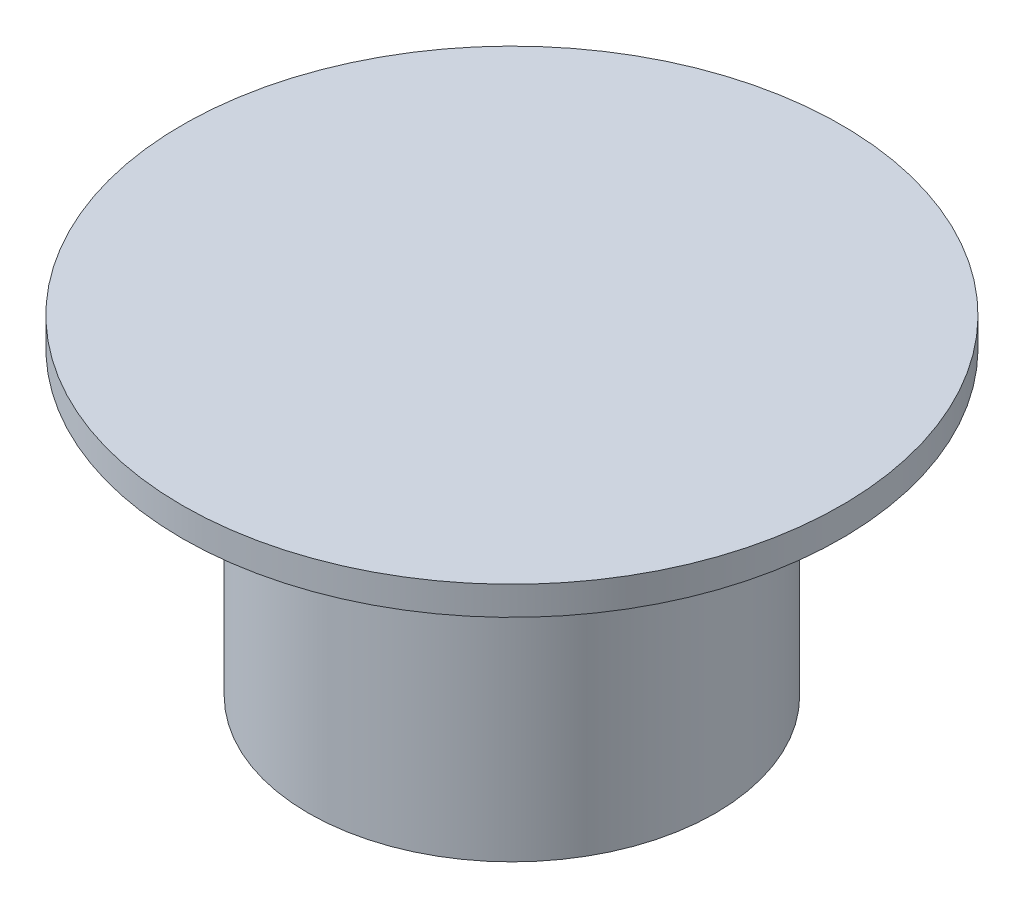
ISO-10303-21;
HEADER;
FILE_DESCRIPTION(('STEP AP214'),'2;1');
FILE_NAME('part.step','',(''),(''),'','','');
FILE_SCHEMA(('AUTOMOTIVE_DESIGN { 1 0 10303 214 1 1 1 1 }'));
ENDSEC;
DATA;
#1=APPLICATION_CONTEXT('core data for automotive mechanical design processes');
#2=APPLICATION_PROTOCOL_DEFINITION('international standard','automotive_design',2000,#1);
#3=PRODUCT_CONTEXT('',#1,'mechanical');
#4=PRODUCT('Part','Part','',(#3));
#5=PRODUCT_RELATED_PRODUCT_CATEGORY('part','',(#4));
#6=PRODUCT_DEFINITION_FORMATION('','',#4);
#7=PRODUCT_DEFINITION_CONTEXT('part definition',#1,'design');
#8=PRODUCT_DEFINITION('design','',#6,#7);
#9=PRODUCT_DEFINITION_SHAPE('','',#8);
#10=(LENGTH_UNIT() NAMED_UNIT(*) SI_UNIT(.MILLI.,.METRE.));
#11=(NAMED_UNIT(*) PLANE_ANGLE_UNIT() SI_UNIT($,.RADIAN.));
#12=(NAMED_UNIT(*) SI_UNIT($,.STERADIAN.) SOLID_ANGLE_UNIT());
#13=UNCERTAINTY_MEASURE_WITH_UNIT(LENGTH_MEASURE(1.E-05),#10,'distance_accuracy_value','');
#14=(GEOMETRIC_REPRESENTATION_CONTEXT(3) GLOBAL_UNCERTAINTY_ASSIGNED_CONTEXT((#13)) GLOBAL_UNIT_ASSIGNED_CONTEXT((#10,
#11,#12)) REPRESENTATION_CONTEXT('',''));
#15=CARTESIAN_POINT('',(0.,0.,0.));
#16=DIRECTION('',(0.,0.,1.));
#17=DIRECTION('',(1.,0.,0.));
#18=AXIS2_PLACEMENT_3D('',#15,#16,#17);
#19=CARTESIAN_POINT('',(0.,10.5,0.));
#20=DIRECTION('',(0.,-1.,0.));
#21=DIRECTION('',(0.,0.,-1.));
#22=AXIS2_PLACEMENT_3D('',#19,#20,#21);
#23=CYLINDRICAL_SURFACE('',#22,7.1);
#24=CARTESIAN_POINT('',(0.,10.5,0.));
#25=DIRECTION('',(0.,1.,0.));
#26=DIRECTION('',(0.,0.,1.));
#27=AXIS2_PLACEMENT_3D('',#24,#25,#26);
#28=CIRCLE('',#27,7.1);
#29=CARTESIAN_POINT('',(0.,10.5,7.1));
#30=VERTEX_POINT('',#29);
#31=EDGE_CURVE('E11',#30,#30,#28,.T.);
#32=ORIENTED_EDGE('',*,*,#31,.F.);
#33=EDGE_LOOP('',(#32));
#34=FACE_BOUND('',#33,.T.);
#35=CARTESIAN_POINT('',(0.,0.,0.));
#36=DIRECTION('',(0.,1.,0.));
#37=DIRECTION('',(0.,0.,1.));
#38=AXIS2_PLACEMENT_3D('',#35,#36,#37);
#39=CIRCLE('',#38,7.1);
#40=CARTESIAN_POINT('',(0.,0.,7.1));
#41=VERTEX_POINT('',#40);
#42=EDGE_CURVE('E36',#41,#41,#39,.T.);
#43=ORIENTED_EDGE('',*,*,#42,.T.);
#44=EDGE_LOOP('',(#43));
#45=FACE_BOUND('',#44,.T.);
#46=ADVANCED_FACE('F33',(#34,#45),#23,.T.);
#47=CARTESIAN_POINT('',(0.,0.,0.));
#48=DIRECTION('',(0.,1.,0.));
#49=DIRECTION('',(0.,0.,1.));
#50=AXIS2_PLACEMENT_3D('',#47,#48,#49);
#51=PLANE('',#50);
#52=DIRECTION('',(1.,0.,0.));
#53=VECTOR('',#52,1.);
#54=CARTESIAN_POINT('',(-2.5,0.,-1.5));
#55=LINE('',#54,#53);
#56=CARTESIAN_POINT('',(-2.5,0.,-1.5));
#57=VERTEX_POINT('',#56);
#58=CARTESIAN_POINT('',(2.5,0.,-1.5));
#59=VERTEX_POINT('',#58);
#60=EDGE_CURVE('E82',#57,#59,#55,.T.);
#61=ORIENTED_EDGE('',*,*,#60,.F.);
#62=DIRECTION('',(0.,0.,-1.));
#63=VECTOR('',#62,1.);
#64=CARTESIAN_POINT('',(-2.5,0.,1.5));
#65=LINE('',#64,#63);
#66=CARTESIAN_POINT('',(-2.5,0.,1.5));
#67=VERTEX_POINT('',#66);
#68=EDGE_CURVE('E47',#67,#57,#65,.T.);
#69=ORIENTED_EDGE('',*,*,#68,.F.);
#70=DIRECTION('',(-1.,0.,0.));
#71=VECTOR('',#70,1.);
#72=CARTESIAN_POINT('',(-2.5,0.,1.5));
#73=LINE('',#72,#71);
#74=CARTESIAN_POINT('',(2.5,0.,1.5));
#75=VERTEX_POINT('',#74);
#76=EDGE_CURVE('E98',#75,#67,#73,.T.);
#77=ORIENTED_EDGE('',*,*,#76,.F.);
#78=DIRECTION('',(0.,0.,1.));
#79=VECTOR('',#78,1.);
#80=CARTESIAN_POINT('',(2.5,0.,1.5));
#81=LINE('',#80,#79);
#82=EDGE_CURVE('E104',#59,#75,#81,.T.);
#83=ORIENTED_EDGE('',*,*,#82,.F.);
#84=EDGE_LOOP('',(#61,#69,#77,#83));
#85=FACE_BOUND('',#84,.T.);
#86=ORIENTED_EDGE('',*,*,#42,.F.);
#87=EDGE_LOOP('',(#86));
#88=FACE_BOUND('',#87,.T.);
#89=ADVANCED_FACE('F122',(#85,#88),#51,.F.);
#90=CARTESIAN_POINT('',(0.,10.5,0.));
#91=DIRECTION('',(0.,1.,0.));
#92=DIRECTION('',(0.,0.,1.));
#93=AXIS2_PLACEMENT_3D('',#90,#91,#92);
#94=PLANE('',#93);
#95=CARTESIAN_POINT('',(0.,10.5,0.));
#96=DIRECTION('',(0.,1.,0.));
#97=DIRECTION('',(0.,0.,1.));
#98=AXIS2_PLACEMENT_3D('',#95,#96,#97);
#99=CIRCLE('',#98,11.5);
#100=CARTESIAN_POINT('',(0.,10.5,11.5));
#101=VERTEX_POINT('',#100);
#102=EDGE_CURVE('E108',#101,#101,#99,.T.);
#103=ORIENTED_EDGE('',*,*,#102,.F.);
#104=EDGE_LOOP('',(#103));
#105=FACE_BOUND('',#104,.T.);
#106=ORIENTED_EDGE('',*,*,#31,.T.);
#107=EDGE_LOOP('',(#106));
#108=FACE_BOUND('',#107,.T.);
#109=ADVANCED_FACE('F119',(#105,#108),#94,.F.);
#110=CARTESIAN_POINT('',(0.,11.5,0.));
#111=DIRECTION('',(0.,-1.,0.));
#112=DIRECTION('',(0.,0.,-1.));
#113=AXIS2_PLACEMENT_3D('',#110,#111,#112);
#114=CYLINDRICAL_SURFACE('',#113,11.5);
#115=CARTESIAN_POINT('',(0.,11.5,0.));
#116=DIRECTION('',(0.,1.,0.));
#117=DIRECTION('',(0.,0.,1.));
#118=AXIS2_PLACEMENT_3D('',#115,#116,#117);
#119=CIRCLE('',#118,11.5);
#120=CARTESIAN_POINT('',(0.,11.5,11.5));
#121=VERTEX_POINT('',#120);
#122=EDGE_CURVE('E111',#121,#121,#119,.T.);
#123=ORIENTED_EDGE('',*,*,#122,.F.);
#124=EDGE_LOOP('',(#123));
#125=FACE_BOUND('',#124,.T.);
#126=ORIENTED_EDGE('',*,*,#102,.T.);
#127=EDGE_LOOP('',(#126));
#128=FACE_BOUND('',#127,.T.);
#129=ADVANCED_FACE('F117',(#125,#128),#114,.T.);
#130=CARTESIAN_POINT('',(0.,11.5,0.));
#131=DIRECTION('',(0.,1.,0.));
#132=DIRECTION('',(0.,0.,1.));
#133=AXIS2_PLACEMENT_3D('',#130,#131,#132);
#134=PLANE('',#133);
#135=ORIENTED_EDGE('',*,*,#122,.T.);
#136=EDGE_LOOP('',(#135));
#137=FACE_BOUND('',#136,.T.);
#138=ADVANCED_FACE('F137',(#137),#134,.T.);
#139=CARTESIAN_POINT('',(-2.5,6.,1.5));
#140=DIRECTION('',(-1.,0.,0.));
#141=DIRECTION('',(0.,0.,1.));
#142=AXIS2_PLACEMENT_3D('',#139,#140,#141);
#143=PLANE('',#142);
#144=ORIENTED_EDGE('',*,*,#68,.T.);
#145=DIRECTION('',(0.,-1.,0.));
#146=VECTOR('',#145,1.);
#147=CARTESIAN_POINT('',(-2.5,6.,-1.5));
#148=LINE('',#147,#146);
#149=CARTESIAN_POINT('',(-2.5,6.,-1.5));
#150=VERTEX_POINT('',#149);
#151=EDGE_CURVE('E70',#150,#57,#148,.T.);
#152=ORIENTED_EDGE('',*,*,#151,.F.);
#153=DIRECTION('',(0.,0.,-1.));
#154=VECTOR('',#153,1.);
#155=CARTESIAN_POINT('',(-2.5,6.,1.5));
#156=LINE('',#155,#154);
#157=CARTESIAN_POINT('',(-2.5,6.,1.5));
#158=VERTEX_POINT('',#157);
#159=EDGE_CURVE('E96',#158,#150,#156,.T.);
#160=ORIENTED_EDGE('',*,*,#159,.F.);
#161=DIRECTION('',(0.,-1.,0.));
#162=VECTOR('',#161,1.);
#163=CARTESIAN_POINT('',(-2.5,6.,1.5));
#164=LINE('',#163,#162);
#165=EDGE_CURVE('E55',#158,#67,#164,.T.);
#166=ORIENTED_EDGE('',*,*,#165,.T.);
#167=EDGE_LOOP('',(#144,#152,#160,#166));
#168=FACE_BOUND('',#167,.T.);
#169=ADVANCED_FACE('F142',(#168),#143,.F.);
#170=CARTESIAN_POINT('',(-2.5,6.,1.5));
#171=DIRECTION('',(0.,0.,1.));
#172=DIRECTION('',(1.,0.,0.));
#173=AXIS2_PLACEMENT_3D('',#170,#171,#172);
#174=PLANE('',#173);
#175=ORIENTED_EDGE('',*,*,#76,.T.);
#176=ORIENTED_EDGE('',*,*,#165,.F.);
#177=DIRECTION('',(-1.,0.,0.));
#178=VECTOR('',#177,1.);
#179=CARTESIAN_POINT('',(-2.5,6.,1.5));
#180=LINE('',#179,#178);
#181=CARTESIAN_POINT('',(2.5,6.,1.5));
#182=VERTEX_POINT('',#181);
#183=EDGE_CURVE('E93',#182,#158,#180,.T.);
#184=ORIENTED_EDGE('',*,*,#183,.F.);
#185=DIRECTION('',(0.,-1.,0.));
#186=VECTOR('',#185,1.);
#187=CARTESIAN_POINT('',(2.5,6.,1.5));
#188=LINE('',#187,#186);
#189=EDGE_CURVE('E86',#182,#75,#188,.T.);
#190=ORIENTED_EDGE('',*,*,#189,.T.);
#191=EDGE_LOOP('',(#175,#176,#184,#190));
#192=FACE_BOUND('',#191,.T.);
#193=ADVANCED_FACE('F146',(#192),#174,.F.);
#194=CARTESIAN_POINT('',(2.5,6.,1.5));
#195=DIRECTION('',(1.,0.,0.));
#196=DIRECTION('',(0.,0.,-1.));
#197=AXIS2_PLACEMENT_3D('',#194,#195,#196);
#198=PLANE('',#197);
#199=ORIENTED_EDGE('',*,*,#82,.T.);
#200=ORIENTED_EDGE('',*,*,#189,.F.);
#201=DIRECTION('',(0.,0.,1.));
#202=VECTOR('',#201,1.);
#203=CARTESIAN_POINT('',(2.5,6.,1.5));
#204=LINE('',#203,#202);
#205=CARTESIAN_POINT('',(2.5,6.,-1.5));
#206=VERTEX_POINT('',#205);
#207=EDGE_CURVE('E89',#206,#182,#204,.T.);
#208=ORIENTED_EDGE('',*,*,#207,.F.);
#209=DIRECTION('',(0.,-1.,0.));
#210=VECTOR('',#209,1.);
#211=CARTESIAN_POINT('',(2.5,6.,-1.5));
#212=LINE('',#211,#210);
#213=EDGE_CURVE('E75',#206,#59,#212,.T.);
#214=ORIENTED_EDGE('',*,*,#213,.T.);
#215=EDGE_LOOP('',(#199,#200,#208,#214));
#216=FACE_BOUND('',#215,.T.);
#217=ADVANCED_FACE('F90',(#216),#198,.F.);
#218=CARTESIAN_POINT('',(-2.5,6.,-1.5));
#219=DIRECTION('',(0.,0.,-1.));
#220=DIRECTION('',(-1.,0.,0.));
#221=AXIS2_PLACEMENT_3D('',#218,#219,#220);
#222=PLANE('',#221);
#223=ORIENTED_EDGE('',*,*,#60,.T.);
#224=ORIENTED_EDGE('',*,*,#213,.F.);
#225=DIRECTION('',(1.,0.,0.));
#226=VECTOR('',#225,1.);
#227=CARTESIAN_POINT('',(-2.5,6.,-1.5));
#228=LINE('',#227,#226);
#229=EDGE_CURVE('E79',#150,#206,#228,.T.);
#230=ORIENTED_EDGE('',*,*,#229,.F.);
#231=ORIENTED_EDGE('',*,*,#151,.T.);
#232=EDGE_LOOP('',(#223,#224,#230,#231));
#233=FACE_BOUND('',#232,.T.);
#234=ADVANCED_FACE('F77',(#233),#222,.F.);
#235=CARTESIAN_POINT('',(0.,6.,0.));
#236=DIRECTION('',(0.,-1.,0.));
#237=DIRECTION('',(0.,0.,-1.));
#238=AXIS2_PLACEMENT_3D('',#235,#236,#237);
#239=PLANE('',#238);
#240=ORIENTED_EDGE('',*,*,#159,.T.);
#241=ORIENTED_EDGE('',*,*,#229,.T.);
#242=ORIENTED_EDGE('',*,*,#207,.T.);
#243=ORIENTED_EDGE('',*,*,#183,.T.);
#244=EDGE_LOOP('',(#240,#241,#242,#243));
#245=FACE_BOUND('',#244,.T.);
#246=ADVANCED_FACE('F95',(#245),#239,.T.);
#247=CLOSED_SHELL('',(#46,#89,#109,#129,#138,#169,#193,#217,#234,#246));
#248=MANIFOLD_SOLID_BREP('B2',#247);
#249=ADVANCED_BREP_SHAPE_REPRESENTATION('',(#18,#248),#14);
#250=SHAPE_DEFINITION_REPRESENTATION(#9,#249);
ENDSEC;
END-ISO-10303-21;
